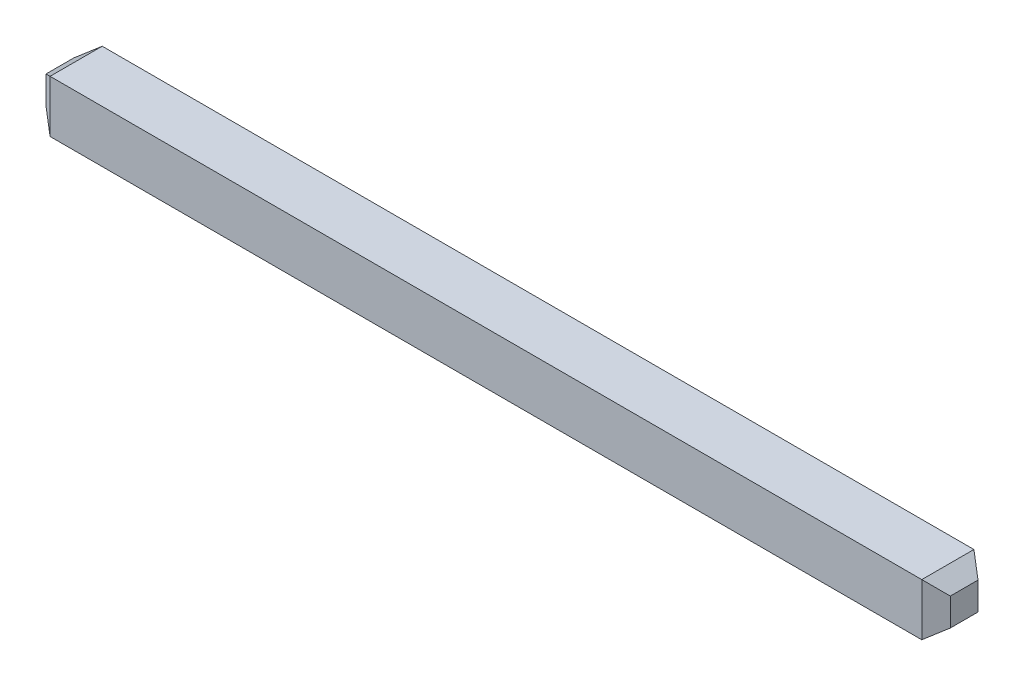
ISO-10303-21;
HEADER;
FILE_DESCRIPTION(('STEP AP214'),'2;1');
FILE_NAME('part.step','',(''),(''),'','','');
FILE_SCHEMA(('AUTOMOTIVE_DESIGN { 1 0 10303 214 1 1 1 1 }'));
ENDSEC;
DATA;
#1=APPLICATION_CONTEXT('core data for automotive mechanical design processes');
#2=APPLICATION_PROTOCOL_DEFINITION('international standard','automotive_design',2000,#1);
#3=PRODUCT_CONTEXT('',#1,'mechanical');
#4=PRODUCT('Part','Part','',(#3));
#5=PRODUCT_RELATED_PRODUCT_CATEGORY('part','',(#4));
#6=PRODUCT_DEFINITION_FORMATION('','',#4);
#7=PRODUCT_DEFINITION_CONTEXT('part definition',#1,'design');
#8=PRODUCT_DEFINITION('design','',#6,#7);
#9=PRODUCT_DEFINITION_SHAPE('','',#8);
#10=(LENGTH_UNIT() NAMED_UNIT(*) SI_UNIT(.MILLI.,.METRE.));
#11=(NAMED_UNIT(*) PLANE_ANGLE_UNIT() SI_UNIT($,.RADIAN.));
#12=(NAMED_UNIT(*) SI_UNIT($,.STERADIAN.) SOLID_ANGLE_UNIT());
#13=UNCERTAINTY_MEASURE_WITH_UNIT(LENGTH_MEASURE(1.E-05),#10,'distance_accuracy_value','');
#14=(GEOMETRIC_REPRESENTATION_CONTEXT(3) GLOBAL_UNCERTAINTY_ASSIGNED_CONTEXT((#13)) GLOBAL_UNIT_ASSIGNED_CONTEXT((#10,
#11,#12)) REPRESENTATION_CONTEXT('',''));
#15=CARTESIAN_POINT('',(0.,0.,0.));
#16=DIRECTION('',(0.,0.,1.));
#17=DIRECTION('',(1.,0.,0.));
#18=AXIS2_PLACEMENT_3D('',#15,#16,#17);
#19=CARTESIAN_POINT('',(-2.4,1.23,-39.615));
#20=DIRECTION('',(0.599999999990736,0.,0.800000000006948));
#21=DIRECTION('',(0.800000000006948,0.,-0.599999999990736));
#22=AXIS2_PLACEMENT_3D('',#19,#20,#21);
#23=PLANE('',#22);
#24=DIRECTION('',(0.,1.,0.));
#25=VECTOR('',#24,1.);
#26=CARTESIAN_POINT('',(-2.3,1.23,-39.69));
#27=LINE('',#26,#25);
#28=CARTESIAN_POINT('',(-2.29999999999957,1.55,-39.6899999999994));
#29=VERTEX_POINT('',#28);
#30=CARTESIAN_POINT('',(-2.29999999999958,0.909999999999898,-39.6899999999994));
#31=VERTEX_POINT('',#30);
#32=EDGE_CURVE('E101',#29,#31,#27,.F.);
#33=ORIENTED_EDGE('',*,*,#32,.T.);
#34=DIRECTION('',(-0.685994340569495,0.514495755428344,0.514495755427429));
#35=VECTOR('',#34,1.);
#36=CARTESIAN_POINT('',(-2.30000000000009,0.909999999999786,-39.69));
#37=LINE('',#36,#35);
#38=CARTESIAN_POINT('',(-2.50000000000021,1.06000000000001,-39.5400000000003));
#39=VERTEX_POINT('',#38);
#40=EDGE_CURVE('E85',#31,#39,#37,.T.);
#41=ORIENTED_EDGE('',*,*,#40,.T.);
#42=DIRECTION('',(0.,1.,0.));
#43=VECTOR('',#42,1.);
#44=CARTESIAN_POINT('',(-2.5,1.23,-39.54));
#45=LINE('',#44,#43);
#46=CARTESIAN_POINT('',(-2.50000000000044,1.4,-39.5400000000006));
#47=VERTEX_POINT('',#46);
#48=EDGE_CURVE('E79',#39,#47,#45,.T.);
#49=ORIENTED_EDGE('',*,*,#48,.T.);
#50=DIRECTION('',(-0.685994340570038,-0.514495755427529,0.51449575542752));
#51=VECTOR('',#50,1.);
#52=CARTESIAN_POINT('',(-2.3,1.55,-39.69));
#53=LINE('',#52,#51);
#54=EDGE_CURVE('E20',#29,#47,#53,.T.);
#55=ORIENTED_EDGE('',*,*,#54,.F.);
#56=EDGE_LOOP('',(#33,#41,#49,#55));
#57=FACE_BOUND('',#56,.T.);
#58=ADVANCED_FACE('F17',(#57),#23,.F.);
#59=CARTESIAN_POINT('',(8.5,1.23,-39.615));
#60=DIRECTION('',(-0.599999999990736,0.,0.800000000006948));
#61=DIRECTION('',(0.800000000006948,0.,0.599999999990736));
#62=AXIS2_PLACEMENT_3D('',#59,#60,#61);
#63=PLANE('',#62);
#64=DIRECTION('',(0.,1.,0.));
#65=VECTOR('',#64,1.);
#66=CARTESIAN_POINT('',(8.6,1.23,-39.54));
#67=LINE('',#66,#65);
#68=CARTESIAN_POINT('',(8.6000000000002,1.06000000000003,-39.5400000000003));
#69=VERTEX_POINT('',#68);
#70=CARTESIAN_POINT('',(8.60000000000044,1.4,-39.5400000000006));
#71=VERTEX_POINT('',#70);
#72=EDGE_CURVE('E113',#69,#71,#67,.T.);
#73=ORIENTED_EDGE('',*,*,#72,.F.);
#74=DIRECTION('',(-0.685994340569496,-0.514495755428343,-0.514495755427429));
#75=VECTOR('',#74,1.);
#76=CARTESIAN_POINT('',(8.59999999999996,1.06000000000005,-39.54));
#77=LINE('',#76,#75);
#78=CARTESIAN_POINT('',(8.39999999999959,0.909999999999884,-39.6899999999994));
#79=VERTEX_POINT('',#78);
#80=EDGE_CURVE('E108',#69,#79,#77,.T.);
#81=ORIENTED_EDGE('',*,*,#80,.T.);
#82=DIRECTION('',(0.,1.,0.));
#83=VECTOR('',#82,1.);
#84=CARTESIAN_POINT('',(8.4,1.23,-39.69));
#85=LINE('',#84,#83);
#86=CARTESIAN_POINT('',(8.39999999999957,1.55,-39.6899999999994));
#87=VERTEX_POINT('',#86);
#88=EDGE_CURVE('E99',#79,#87,#85,.T.);
#89=ORIENTED_EDGE('',*,*,#88,.T.);
#90=DIRECTION('',(-0.685994340570037,0.514495755427528,-0.514495755427522));
#91=VECTOR('',#90,1.);
#92=CARTESIAN_POINT('',(8.6,1.4,-39.54));
#93=LINE('',#92,#91);
#94=EDGE_CURVE('E116',#71,#87,#93,.T.);
#95=ORIENTED_EDGE('',*,*,#94,.F.);
#96=EDGE_LOOP('',(#73,#81,#89,#95));
#97=FACE_BOUND('',#96,.T.);
#98=ADVANCED_FACE('F214',(#97),#63,.F.);
#99=CARTESIAN_POINT('',(-2.4,1.475,-39.37));
#100=DIRECTION('',(-0.6,0.8,0.));
#101=DIRECTION('',(-0.8,-0.6,0.));
#102=AXIS2_PLACEMENT_3D('',#99,#100,#101);
#103=PLANE('',#102);
#104=DIRECTION('',(-0.685994340575994,-0.514495755427521,-0.514495755419586));
#105=VECTOR('',#104,1.);
#106=CARTESIAN_POINT('',(-2.29999999999913,1.55,-39.0500000000012));
#107=LINE('',#106,#105);
#108=CARTESIAN_POINT('',(-2.29999999999989,1.55,-39.0500000000001));
#109=VERTEX_POINT('',#108);
#110=CARTESIAN_POINT('',(-2.50000000000022,1.4,-39.1999999999997));
#111=VERTEX_POINT('',#110);
#112=EDGE_CURVE('E128',#109,#111,#107,.T.);
#113=ORIENTED_EDGE('',*,*,#112,.F.);
#114=DIRECTION('',(0.,0.,1.));
#115=VECTOR('',#114,1.);
#116=CARTESIAN_POINT('',(-2.3,1.55,-39.37));
#117=LINE('',#116,#115);
#118=EDGE_CURVE('E93',#29,#109,#117,.T.);
#119=ORIENTED_EDGE('',*,*,#118,.F.);
#120=ORIENTED_EDGE('',*,*,#54,.T.);
#121=DIRECTION('',(0.,0.,-1.));
#122=VECTOR('',#121,1.);
#123=CARTESIAN_POINT('',(-2.5,1.4,-39.37));
#124=LINE('',#123,#122);
#125=EDGE_CURVE('E87',#47,#111,#124,.F.);
#126=ORIENTED_EDGE('',*,*,#125,.T.);
#127=EDGE_LOOP('',(#113,#119,#120,#126));
#128=FACE_BOUND('',#127,.T.);
#129=ADVANCED_FACE('F90',(#128),#103,.T.);
#130=CARTESIAN_POINT('',(-2.5,1.23,-39.37));
#131=DIRECTION('',(1.,0.,0.));
#132=DIRECTION('',(0.,0.,-1.));
#133=AXIS2_PLACEMENT_3D('',#130,#131,#132);
#134=PLANE('',#133);
#135=DIRECTION('',(0.,1.,0.));
#136=VECTOR('',#135,1.);
#137=CARTESIAN_POINT('',(-2.50000000000087,1.23,-39.1999999999988));
#138=LINE('',#137,#136);
#139=CARTESIAN_POINT('',(-2.50000000000021,1.06000000000001,-39.1999999999997));
#140=VERTEX_POINT('',#139);
#141=EDGE_CURVE('E97',#111,#140,#138,.F.);
#142=ORIENTED_EDGE('',*,*,#141,.F.);
#143=ORIENTED_EDGE('',*,*,#125,.F.);
#144=ORIENTED_EDGE('',*,*,#48,.F.);
#145=DIRECTION('',(0.,0.,1.));
#146=VECTOR('',#145,1.);
#147=CARTESIAN_POINT('',(-2.49999999999996,1.06000000000005,-39.37));
#148=LINE('',#147,#146);
#149=EDGE_CURVE('E105',#39,#140,#148,.T.);
#150=ORIENTED_EDGE('',*,*,#149,.T.);
#151=EDGE_LOOP('',(#142,#143,#144,#150));
#152=FACE_BOUND('',#151,.T.);
#153=ADVANCED_FACE('F95',(#152),#134,.F.);
#154=CARTESIAN_POINT('',(3.05,1.23,-39.69));
#155=DIRECTION('',(0.,0.,1.));
#156=DIRECTION('',(1.,0.,0.));
#157=AXIS2_PLACEMENT_3D('',#154,#155,#156);
#158=PLANE('',#157);
#159=ORIENTED_EDGE('',*,*,#32,.F.);
#160=DIRECTION('',(1.,0.,0.));
#161=VECTOR('',#160,1.);
#162=CARTESIAN_POINT('',(3.05,1.55,-39.69));
#163=LINE('',#162,#161);
#164=EDGE_CURVE('E122',#87,#29,#163,.F.);
#165=ORIENTED_EDGE('',*,*,#164,.F.);
#166=ORIENTED_EDGE('',*,*,#88,.F.);
#167=DIRECTION('',(1.,0.,0.));
#168=VECTOR('',#167,1.);
#169=CARTESIAN_POINT('',(3.05,0.91,-39.69));
#170=LINE('',#169,#168);
#171=EDGE_CURVE('E136',#79,#31,#170,.F.);
#172=ORIENTED_EDGE('',*,*,#171,.T.);
#173=EDGE_LOOP('',(#159,#165,#166,#172));
#174=FACE_BOUND('',#173,.T.);
#175=ADVANCED_FACE('F182',(#174),#158,.F.);
#176=CARTESIAN_POINT('',(-2.4,0.9849999999999,-39.37));
#177=DIRECTION('',(0.600000000000912,0.799999999999316,0.));
#178=DIRECTION('',(-0.799999999999316,0.600000000000912,0.));
#179=AXIS2_PLACEMENT_3D('',#176,#177,#178);
#180=PLANE('',#179);
#181=DIRECTION('',(0.,0.,1.));
#182=VECTOR('',#181,1.);
#183=CARTESIAN_POINT('',(-2.3,0.91,-39.37));
#184=LINE('',#183,#182);
#185=CARTESIAN_POINT('',(-2.29999999999983,0.909999999999856,-39.0500000000003));
#186=VERTEX_POINT('',#185);
#187=EDGE_CURVE('E139',#31,#186,#184,.T.);
#188=ORIENTED_EDGE('',*,*,#187,.T.);
#189=DIRECTION('',(0.685994340575873,-0.514495755427774,0.514495755419495));
#190=VECTOR('',#189,1.);
#191=CARTESIAN_POINT('',(-2.50000000000087,1.06,-39.1999999999988));
#192=LINE('',#191,#190);
#193=EDGE_CURVE('E131',#140,#186,#192,.T.);
#194=ORIENTED_EDGE('',*,*,#193,.F.);
#195=ORIENTED_EDGE('',*,*,#149,.F.);
#196=ORIENTED_EDGE('',*,*,#40,.F.);
#197=EDGE_LOOP('',(#188,#194,#195,#196));
#198=FACE_BOUND('',#197,.T.);
#199=ADVANCED_FACE('F179',(#198),#180,.F.);
#200=CARTESIAN_POINT('',(8.5,0.9849999999999,-39.37));
#201=DIRECTION('',(-0.600000000000912,0.799999999999316,0.));
#202=DIRECTION('',(-0.799999999999316,-0.600000000000912,0.));
#203=AXIS2_PLACEMENT_3D('',#200,#201,#202);
#204=PLANE('',#203);
#205=DIRECTION('',(0.,0.,-1.));
#206=VECTOR('',#205,1.);
#207=CARTESIAN_POINT('',(8.6,1.06,-39.37));
#208=LINE('',#207,#206);
#209=CARTESIAN_POINT('',(8.6000000000002,1.06000000000003,-39.1999999999997));
#210=VERTEX_POINT('',#209);
#211=EDGE_CURVE('E110',#210,#69,#208,.T.);
#212=ORIENTED_EDGE('',*,*,#211,.F.);
#213=DIRECTION('',(0.685994340575872,0.514495755427775,-0.514495755419496));
#214=VECTOR('',#213,1.);
#215=CARTESIAN_POINT('',(8.39999999999913,0.9099999999999,-39.0500000000012));
#216=LINE('',#215,#214);
#217=CARTESIAN_POINT('',(8.39999999999993,0.909999999999868,-39.0500000000001));
#218=VERTEX_POINT('',#217);
#219=EDGE_CURVE('E35',#218,#210,#216,.T.);
#220=ORIENTED_EDGE('',*,*,#219,.F.);
#221=DIRECTION('',(0.,0.,1.));
#222=VECTOR('',#221,1.);
#223=CARTESIAN_POINT('',(8.4,0.91,-39.37));
#224=LINE('',#223,#222);
#225=EDGE_CURVE('E134',#218,#79,#224,.F.);
#226=ORIENTED_EDGE('',*,*,#225,.T.);
#227=ORIENTED_EDGE('',*,*,#80,.F.);
#228=EDGE_LOOP('',(#212,#220,#226,#227));
#229=FACE_BOUND('',#228,.T.);
#230=ADVANCED_FACE('F181',(#229),#204,.F.);
#231=CARTESIAN_POINT('',(8.6,1.23,-39.37));
#232=DIRECTION('',(1.,0.,0.));
#233=DIRECTION('',(0.,0.,-1.));
#234=AXIS2_PLACEMENT_3D('',#231,#232,#233);
#235=PLANE('',#234);
#236=ORIENTED_EDGE('',*,*,#72,.T.);
#237=DIRECTION('',(0.,0.,1.));
#238=VECTOR('',#237,1.);
#239=CARTESIAN_POINT('',(8.6,1.4,-39.37));
#240=LINE('',#239,#238);
#241=CARTESIAN_POINT('',(8.60000000000022,1.4,-39.1999999999997));
#242=VERTEX_POINT('',#241);
#243=EDGE_CURVE('E119',#242,#71,#240,.F.);
#244=ORIENTED_EDGE('',*,*,#243,.F.);
#245=DIRECTION('',(0.,1.,0.));
#246=VECTOR('',#245,1.);
#247=CARTESIAN_POINT('',(8.60000000000087,1.23,-39.1999999999988));
#248=LINE('',#247,#246);
#249=EDGE_CURVE('E142',#210,#242,#248,.T.);
#250=ORIENTED_EDGE('',*,*,#249,.F.);
#251=ORIENTED_EDGE('',*,*,#211,.T.);
#252=EDGE_LOOP('',(#236,#244,#250,#251));
#253=FACE_BOUND('',#252,.T.);
#254=ADVANCED_FACE('F189',(#253),#235,.T.);
#255=CARTESIAN_POINT('',(8.5,1.475,-39.37));
#256=DIRECTION('',(0.6,0.8,0.));
#257=DIRECTION('',(-0.8,0.6,0.));
#258=AXIS2_PLACEMENT_3D('',#255,#256,#257);
#259=PLANE('',#258);
#260=DIRECTION('',(-0.685994340575993,0.514495755427522,0.514495755419587));
#261=VECTOR('',#260,1.);
#262=CARTESIAN_POINT('',(8.60000000000087,1.4,-39.1999999999988));
#263=LINE('',#262,#261);
#264=CARTESIAN_POINT('',(8.39999999999989,1.55,-39.0500000000001));
#265=VERTEX_POINT('',#264);
#266=EDGE_CURVE('E145',#242,#265,#263,.T.);
#267=ORIENTED_EDGE('',*,*,#266,.F.);
#268=ORIENTED_EDGE('',*,*,#243,.T.);
#269=ORIENTED_EDGE('',*,*,#94,.T.);
#270=DIRECTION('',(0.,0.,1.));
#271=VECTOR('',#270,1.);
#272=CARTESIAN_POINT('',(8.4,1.55,-39.37));
#273=LINE('',#272,#271);
#274=EDGE_CURVE('E125',#265,#87,#273,.F.);
#275=ORIENTED_EDGE('',*,*,#274,.F.);
#276=EDGE_LOOP('',(#267,#268,#269,#275));
#277=FACE_BOUND('',#276,.T.);
#278=ADVANCED_FACE('F170',(#277),#259,.T.);
#279=CARTESIAN_POINT('',(3.05,1.55,-39.37));
#280=DIRECTION('',(0.,1.,0.));
#281=DIRECTION('',(0.,0.,1.));
#282=AXIS2_PLACEMENT_3D('',#279,#280,#281);
#283=PLANE('',#282);
#284=DIRECTION('',(1.,0.,0.));
#285=VECTOR('',#284,1.);
#286=CARTESIAN_POINT('',(3.05,1.55,-39.05));
#287=LINE('',#286,#285);
#288=EDGE_CURVE('E148',#265,#109,#287,.F.);
#289=ORIENTED_EDGE('',*,*,#288,.F.);
#290=ORIENTED_EDGE('',*,*,#274,.T.);
#291=ORIENTED_EDGE('',*,*,#164,.T.);
#292=ORIENTED_EDGE('',*,*,#118,.T.);
#293=EDGE_LOOP('',(#289,#290,#291,#292));
#294=FACE_BOUND('',#293,.T.);
#295=ADVANCED_FACE('F173',(#294),#283,.T.);
#296=CARTESIAN_POINT('',(-2.4,1.23,-39.125));
#297=DIRECTION('',(-0.599999999990736,0.,0.800000000006948));
#298=DIRECTION('',(0.800000000006948,0.,0.599999999990736));
#299=AXIS2_PLACEMENT_3D('',#296,#297,#298);
#300=PLANE('',#299);
#301=ORIENTED_EDGE('',*,*,#193,.T.);
#302=DIRECTION('',(0.,1.,0.));
#303=VECTOR('',#302,1.);
#304=CARTESIAN_POINT('',(-2.3,1.23,-39.05));
#305=LINE('',#304,#303);
#306=EDGE_CURVE('E151',#109,#186,#305,.F.);
#307=ORIENTED_EDGE('',*,*,#306,.F.);
#308=ORIENTED_EDGE('',*,*,#112,.T.);
#309=ORIENTED_EDGE('',*,*,#141,.T.);
#310=EDGE_LOOP('',(#301,#307,#308,#309));
#311=FACE_BOUND('',#310,.T.);
#312=ADVANCED_FACE('F176',(#311),#300,.T.);
#313=CARTESIAN_POINT('',(3.05,0.91,-39.37));
#314=DIRECTION('',(0.,1.,0.));
#315=DIRECTION('',(0.,0.,1.));
#316=AXIS2_PLACEMENT_3D('',#313,#314,#315);
#317=PLANE('',#316);
#318=ORIENTED_EDGE('',*,*,#187,.F.);
#319=ORIENTED_EDGE('',*,*,#171,.F.);
#320=ORIENTED_EDGE('',*,*,#225,.F.);
#321=DIRECTION('',(1.,0.,0.));
#322=VECTOR('',#321,1.);
#323=CARTESIAN_POINT('',(3.05,0.9099999999999,-39.05));
#324=LINE('',#323,#322);
#325=EDGE_CURVE('E26',#186,#218,#324,.T.);
#326=ORIENTED_EDGE('',*,*,#325,.F.);
#327=EDGE_LOOP('',(#318,#319,#320,#326));
#328=FACE_BOUND('',#327,.T.);
#329=ADVANCED_FACE('F162',(#328),#317,.F.);
#330=CARTESIAN_POINT('',(8.5,1.23,-39.125));
#331=DIRECTION('',(0.599999999990736,0.,0.800000000006948));
#332=DIRECTION('',(0.800000000006948,0.,-0.599999999990736));
#333=AXIS2_PLACEMENT_3D('',#330,#331,#332);
#334=PLANE('',#333);
#335=ORIENTED_EDGE('',*,*,#266,.T.);
#336=DIRECTION('',(0.,1.,0.));
#337=VECTOR('',#336,1.);
#338=CARTESIAN_POINT('',(8.4,1.23,-39.05));
#339=LINE('',#338,#337);
#340=EDGE_CURVE('E11',#218,#265,#339,.T.);
#341=ORIENTED_EDGE('',*,*,#340,.F.);
#342=ORIENTED_EDGE('',*,*,#219,.T.);
#343=ORIENTED_EDGE('',*,*,#249,.T.);
#344=EDGE_LOOP('',(#335,#341,#342,#343));
#345=FACE_BOUND('',#344,.T.);
#346=ADVANCED_FACE('F166',(#345),#334,.T.);
#347=CARTESIAN_POINT('',(3.05,1.23,-39.05));
#348=DIRECTION('',(0.,0.,1.));
#349=DIRECTION('',(1.,0.,0.));
#350=AXIS2_PLACEMENT_3D('',#347,#348,#349);
#351=PLANE('',#350);
#352=ORIENTED_EDGE('',*,*,#325,.T.);
#353=ORIENTED_EDGE('',*,*,#340,.T.);
#354=ORIENTED_EDGE('',*,*,#288,.T.);
#355=ORIENTED_EDGE('',*,*,#306,.T.);
#356=EDGE_LOOP('',(#352,#353,#354,#355));
#357=FACE_BOUND('',#356,.T.);
#358=ADVANCED_FACE('F157',(#357),#351,.T.);
#359=CLOSED_SHELL('',(#58,#98,#129,#153,#175,#199,#230,#254,#278,#295,#312,#329,#346,#358));
#360=MANIFOLD_SOLID_BREP('B1',#359);
#361=ADVANCED_BREP_SHAPE_REPRESENTATION('',(#18,#360),#14);
#362=SHAPE_DEFINITION_REPRESENTATION(#9,#361);
ENDSEC;
END-ISO-10303-21;
